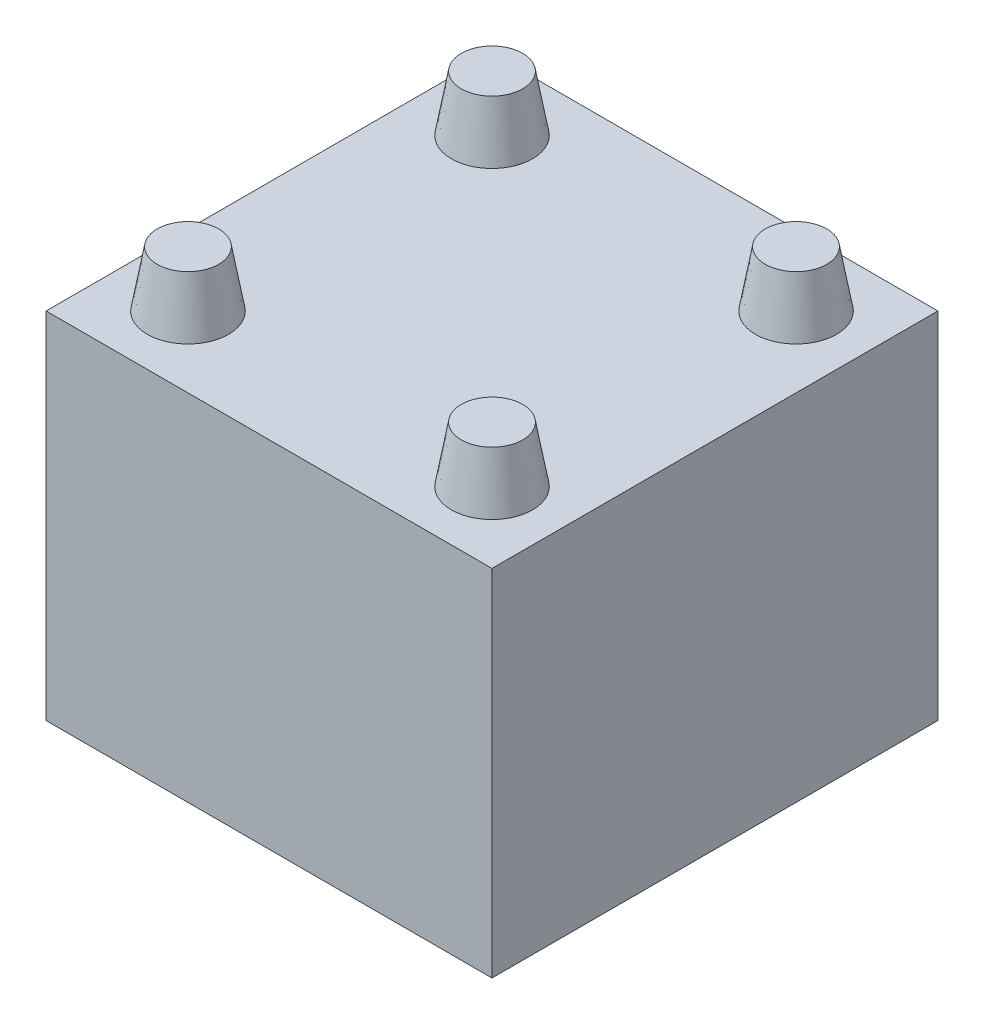
ISO-10303-21;
HEADER;
FILE_DESCRIPTION(('STEP AP214'),'2;1');
FILE_NAME('part.step','',(''),(''),'','','');
FILE_SCHEMA(('AUTOMOTIVE_DESIGN { 1 0 10303 214 1 1 1 1 }'));
ENDSEC;
DATA;
#1=APPLICATION_CONTEXT('core data for automotive mechanical design processes');
#2=APPLICATION_PROTOCOL_DEFINITION('international standard','automotive_design',2000,#1);
#3=PRODUCT_CONTEXT('',#1,'mechanical');
#4=PRODUCT('Part','Part','',(#3));
#5=PRODUCT_RELATED_PRODUCT_CATEGORY('part','',(#4));
#6=PRODUCT_DEFINITION_FORMATION('','',#4);
#7=PRODUCT_DEFINITION_CONTEXT('part definition',#1,'design');
#8=PRODUCT_DEFINITION('design','',#6,#7);
#9=PRODUCT_DEFINITION_SHAPE('','',#8);
#10=(LENGTH_UNIT() NAMED_UNIT(*) SI_UNIT(.MILLI.,.METRE.));
#11=(NAMED_UNIT(*) PLANE_ANGLE_UNIT() SI_UNIT($,.RADIAN.));
#12=(NAMED_UNIT(*) SI_UNIT($,.STERADIAN.) SOLID_ANGLE_UNIT());
#13=UNCERTAINTY_MEASURE_WITH_UNIT(LENGTH_MEASURE(1.E-05),#10,'distance_accuracy_value','');
#14=(GEOMETRIC_REPRESENTATION_CONTEXT(3) GLOBAL_UNCERTAINTY_ASSIGNED_CONTEXT((#13)) GLOBAL_UNIT_ASSIGNED_CONTEXT((#10,
#11,#12)) REPRESENTATION_CONTEXT('',''));
#15=CARTESIAN_POINT('',(0.,0.,0.));
#16=DIRECTION('',(0.,0.,1.));
#17=DIRECTION('',(1.,0.,0.));
#18=AXIS2_PLACEMENT_3D('',#15,#16,#17);
#19=CARTESIAN_POINT('',(-11.,3.,11.));
#20=DIRECTION('',(1.,0.,0.));
#21=DIRECTION('',(0.,0.,-1.));
#22=AXIS2_PLACEMENT_3D('',#19,#20,#21);
#23=PLANE('',#22);
#24=DIRECTION('',(0.,0.,1.));
#25=VECTOR('',#24,1.);
#26=CARTESIAN_POINT('',(-11.,0.,11.));
#27=LINE('',#26,#25);
#28=CARTESIAN_POINT('',(-11.,0.,-11.));
#29=VERTEX_POINT('',#28);
#30=CARTESIAN_POINT('',(-11.,0.,11.));
#31=VERTEX_POINT('',#30);
#32=EDGE_CURVE('E147',#29,#31,#27,.T.);
#33=ORIENTED_EDGE('',*,*,#32,.T.);
#34=DIRECTION('',(0.,-1.,0.));
#35=VECTOR('',#34,1.);
#36=CARTESIAN_POINT('',(-11.,3.,11.));
#37=LINE('',#36,#35);
#38=CARTESIAN_POINT('',(-11.,17.5,11.));
#39=VERTEX_POINT('',#38);
#40=EDGE_CURVE('E12',#39,#31,#37,.T.);
#41=ORIENTED_EDGE('',*,*,#40,.F.);
#42=DIRECTION('',(0.,0.,1.));
#43=VECTOR('',#42,1.);
#44=CARTESIAN_POINT('',(-11.,17.5,-11.));
#45=LINE('',#44,#43);
#46=CARTESIAN_POINT('',(-11.,17.5,-11.));
#47=VERTEX_POINT('',#46);
#48=EDGE_CURVE('E107',#47,#39,#45,.T.);
#49=ORIENTED_EDGE('',*,*,#48,.F.);
#50=DIRECTION('',(0.,-1.,0.));
#51=VECTOR('',#50,1.);
#52=CARTESIAN_POINT('',(-11.,3.,-11.));
#53=LINE('',#52,#51);
#54=EDGE_CURVE('E157',#47,#29,#53,.T.);
#55=ORIENTED_EDGE('',*,*,#54,.T.);
#56=EDGE_LOOP('',(#33,#41,#49,#55));
#57=FACE_BOUND('',#56,.T.);
#58=ADVANCED_FACE('F47',(#57),#23,.F.);
#59=CARTESIAN_POINT('',(-11.,3.,11.));
#60=DIRECTION('',(0.,0.,-1.));
#61=DIRECTION('',(-1.,0.,0.));
#62=AXIS2_PLACEMENT_3D('',#59,#60,#61);
#63=PLANE('',#62);
#64=DIRECTION('',(1.,0.,0.));
#65=VECTOR('',#64,1.);
#66=CARTESIAN_POINT('',(-11.,0.,11.));
#67=LINE('',#66,#65);
#68=CARTESIAN_POINT('',(11.,0.,11.));
#69=VERTEX_POINT('',#68);
#70=EDGE_CURVE('E93',#31,#69,#67,.T.);
#71=ORIENTED_EDGE('',*,*,#70,.T.);
#72=DIRECTION('',(0.,-1.,0.));
#73=VECTOR('',#72,1.);
#74=CARTESIAN_POINT('',(11.,3.,11.));
#75=LINE('',#74,#73);
#76=CARTESIAN_POINT('',(11.,17.5,11.));
#77=VERTEX_POINT('',#76);
#78=EDGE_CURVE('E55',#77,#69,#75,.T.);
#79=ORIENTED_EDGE('',*,*,#78,.F.);
#80=DIRECTION('',(1.,0.,0.));
#81=VECTOR('',#80,1.);
#82=CARTESIAN_POINT('',(-11.,17.5,11.));
#83=LINE('',#82,#81);
#84=EDGE_CURVE('E91',#39,#77,#83,.T.);
#85=ORIENTED_EDGE('',*,*,#84,.F.);
#86=ORIENTED_EDGE('',*,*,#40,.T.);
#87=EDGE_LOOP('',(#71,#79,#85,#86));
#88=FACE_BOUND('',#87,.T.);
#89=ADVANCED_FACE('F89',(#88),#63,.F.);
#90=CARTESIAN_POINT('',(11.,3.,11.));
#91=DIRECTION('',(-1.,0.,0.));
#92=DIRECTION('',(0.,0.,1.));
#93=AXIS2_PLACEMENT_3D('',#90,#91,#92);
#94=PLANE('',#93);
#95=DIRECTION('',(0.,0.,-1.));
#96=VECTOR('',#95,1.);
#97=CARTESIAN_POINT('',(11.,0.,11.));
#98=LINE('',#97,#96);
#99=CARTESIAN_POINT('',(11.,0.,-11.));
#100=VERTEX_POINT('',#99);
#101=EDGE_CURVE('E70',#69,#100,#98,.T.);
#102=ORIENTED_EDGE('',*,*,#101,.T.);
#103=DIRECTION('',(0.,-1.,0.));
#104=VECTOR('',#103,1.);
#105=CARTESIAN_POINT('',(11.,3.,-11.));
#106=LINE('',#105,#104);
#107=CARTESIAN_POINT('',(11.,17.5,-11.));
#108=VERTEX_POINT('',#107);
#109=EDGE_CURVE('E95',#108,#100,#106,.T.);
#110=ORIENTED_EDGE('',*,*,#109,.F.);
#111=DIRECTION('',(0.,0.,-1.));
#112=VECTOR('',#111,1.);
#113=CARTESIAN_POINT('',(11.,17.5,11.));
#114=LINE('',#113,#112);
#115=EDGE_CURVE('E97',#77,#108,#114,.T.);
#116=ORIENTED_EDGE('',*,*,#115,.F.);
#117=ORIENTED_EDGE('',*,*,#78,.T.);
#118=EDGE_LOOP('',(#102,#110,#116,#117));
#119=FACE_BOUND('',#118,.T.);
#120=ADVANCED_FACE('F98',(#119),#94,.F.);
#121=CARTESIAN_POINT('',(-11.,3.,-11.));
#122=DIRECTION('',(0.,0.,1.));
#123=DIRECTION('',(1.,0.,0.));
#124=AXIS2_PLACEMENT_3D('',#121,#122,#123);
#125=PLANE('',#124);
#126=DIRECTION('',(-1.,0.,0.));
#127=VECTOR('',#126,1.);
#128=CARTESIAN_POINT('',(-11.,0.,-11.));
#129=LINE('',#128,#127);
#130=EDGE_CURVE('E62',#100,#29,#129,.T.);
#131=ORIENTED_EDGE('',*,*,#130,.T.);
#132=ORIENTED_EDGE('',*,*,#54,.F.);
#133=DIRECTION('',(-1.,0.,0.));
#134=VECTOR('',#133,1.);
#135=CARTESIAN_POINT('',(11.,17.5,-11.));
#136=LINE('',#135,#134);
#137=EDGE_CURVE('E103',#108,#47,#136,.T.);
#138=ORIENTED_EDGE('',*,*,#137,.F.);
#139=ORIENTED_EDGE('',*,*,#109,.T.);
#140=EDGE_LOOP('',(#131,#132,#138,#139));
#141=FACE_BOUND('',#140,.T.);
#142=ADVANCED_FACE('F161',(#141),#125,.F.);
#143=CARTESIAN_POINT('',(0.,0.,0.));
#144=DIRECTION('',(0.,-1.,0.));
#145=DIRECTION('',(0.,0.,-1.));
#146=AXIS2_PLACEMENT_3D('',#143,#144,#145);
#147=PLANE('',#146);
#148=ORIENTED_EDGE('',*,*,#32,.F.);
#149=ORIENTED_EDGE('',*,*,#130,.F.);
#150=ORIENTED_EDGE('',*,*,#101,.F.);
#151=ORIENTED_EDGE('',*,*,#70,.F.);
#152=EDGE_LOOP('',(#148,#149,#150,#151));
#153=FACE_BOUND('',#152,.T.);
#154=ADVANCED_FACE('F164',(#153),#147,.T.);
#155=CARTESIAN_POINT('',(7.5,20.25,7.5));
#156=DIRECTION('',(0.,1.,0.));
#157=DIRECTION('',(0.,0.,1.));
#158=AXIS2_PLACEMENT_3D('',#155,#156,#157);
#159=PLANE('',#158);
#160=CARTESIAN_POINT('',(7.5,20.25,7.5));
#161=DIRECTION('',(0.,1.,0.));
#162=DIRECTION('',(0.,0.,1.));
#163=AXIS2_PLACEMENT_3D('',#160,#161,#162);
#164=CIRCLE('',#163,1.51510080305172);
#165=CARTESIAN_POINT('',(7.5,20.25,9.01510080305172));
#166=VERTEX_POINT('',#165);
#167=EDGE_CURVE('E127',#166,#166,#164,.T.);
#168=ORIENTED_EDGE('',*,*,#167,.T.);
#169=EDGE_LOOP('',(#168));
#170=FACE_BOUND('',#169,.T.);
#171=ADVANCED_FACE('F180',(#170),#159,.T.);
#172=CARTESIAN_POINT('',(7.5,20.25,-7.5));
#173=DIRECTION('',(0.,1.,0.));
#174=DIRECTION('',(0.,0.,1.));
#175=AXIS2_PLACEMENT_3D('',#172,#173,#174);
#176=PLANE('',#175);
#177=CARTESIAN_POINT('',(7.5,20.25,-7.5));
#178=DIRECTION('',(0.,1.,0.));
#179=DIRECTION('',(0.,0.,1.));
#180=AXIS2_PLACEMENT_3D('',#177,#178,#179);
#181=CIRCLE('',#180,1.51510080305172);
#182=CARTESIAN_POINT('',(7.5,20.25,-5.98489919694828));
#183=VERTEX_POINT('',#182);
#184=EDGE_CURVE('E123',#183,#183,#181,.T.);
#185=ORIENTED_EDGE('',*,*,#184,.T.);
#186=EDGE_LOOP('',(#185));
#187=FACE_BOUND('',#186,.T.);
#188=ADVANCED_FACE('F188',(#187),#176,.T.);
#189=CARTESIAN_POINT('',(-7.5,20.25,-7.5));
#190=DIRECTION('',(0.,1.,0.));
#191=DIRECTION('',(0.,0.,1.));
#192=AXIS2_PLACEMENT_3D('',#189,#190,#191);
#193=PLANE('',#192);
#194=CARTESIAN_POINT('',(-7.5,20.25,-7.5));
#195=DIRECTION('',(0.,1.,0.));
#196=DIRECTION('',(0.,0.,1.));
#197=AXIS2_PLACEMENT_3D('',#194,#195,#196);
#198=CIRCLE('',#197,1.51510080305172);
#199=CARTESIAN_POINT('',(-7.5,20.25,-5.98489919694828));
#200=VERTEX_POINT('',#199);
#201=EDGE_CURVE('E114',#200,#200,#198,.T.);
#202=ORIENTED_EDGE('',*,*,#201,.T.);
#203=EDGE_LOOP('',(#202));
#204=FACE_BOUND('',#203,.T.);
#205=ADVANCED_FACE('F192',(#204),#193,.T.);
#206=CARTESIAN_POINT('',(-7.5,20.25,7.5));
#207=DIRECTION('',(0.,1.,0.));
#208=DIRECTION('',(0.,0.,1.));
#209=AXIS2_PLACEMENT_3D('',#206,#207,#208);
#210=PLANE('',#209);
#211=CARTESIAN_POINT('',(-7.5,20.25,7.5));
#212=DIRECTION('',(0.,1.,0.));
#213=DIRECTION('',(0.,0.,1.));
#214=AXIS2_PLACEMENT_3D('',#211,#212,#213);
#215=CIRCLE('',#214,1.51510080305172);
#216=CARTESIAN_POINT('',(-7.5,20.25,9.01510080305172));
#217=VERTEX_POINT('',#216);
#218=EDGE_CURVE('E109',#217,#217,#215,.T.);
#219=ORIENTED_EDGE('',*,*,#218,.T.);
#220=EDGE_LOOP('',(#219));
#221=FACE_BOUND('',#220,.T.);
#222=ADVANCED_FACE('F200',(#221),#210,.T.);
#223=CARTESIAN_POINT('',(-7.5,17.5,7.5));
#224=DIRECTION('',(0.,1.,0.));
#225=DIRECTION('',(0.,0.,1.));
#226=AXIS2_PLACEMENT_3D('',#223,#224,#225);
#227=PLANE('',#226);
#228=CARTESIAN_POINT('',(7.5,17.5,-7.5));
#229=DIRECTION('',(0.,1.,0.));
#230=DIRECTION('',(0.,0.,1.));
#231=AXIS2_PLACEMENT_3D('',#228,#229,#230);
#232=CIRCLE('',#231,2.);
#233=CARTESIAN_POINT('',(7.5,17.5,-5.5));
#234=VERTEX_POINT('',#233);
#235=EDGE_CURVE('E139',#234,#234,#232,.T.);
#236=ORIENTED_EDGE('',*,*,#235,.F.);
#237=EDGE_LOOP('',(#236));
#238=FACE_BOUND('',#237,.T.);
#239=CARTESIAN_POINT('',(-7.5,17.5,7.5));
#240=DIRECTION('',(0.,1.,0.));
#241=DIRECTION('',(0.,0.,1.));
#242=AXIS2_PLACEMENT_3D('',#239,#240,#241);
#243=CIRCLE('',#242,2.);
#244=CARTESIAN_POINT('',(-7.5,17.5,9.5));
#245=VERTEX_POINT('',#244);
#246=EDGE_CURVE('E131',#245,#245,#243,.T.);
#247=ORIENTED_EDGE('',*,*,#246,.F.);
#248=EDGE_LOOP('',(#247));
#249=FACE_BOUND('',#248,.T.);
#250=CARTESIAN_POINT('',(-7.5,17.5,-7.5));
#251=DIRECTION('',(0.,1.,0.));
#252=DIRECTION('',(0.,0.,1.));
#253=AXIS2_PLACEMENT_3D('',#250,#251,#252);
#254=CIRCLE('',#253,2.);
#255=CARTESIAN_POINT('',(-7.5,17.5,-5.5));
#256=VERTEX_POINT('',#255);
#257=EDGE_CURVE('E143',#256,#256,#254,.T.);
#258=ORIENTED_EDGE('',*,*,#257,.F.);
#259=EDGE_LOOP('',(#258));
#260=FACE_BOUND('',#259,.T.);
#261=CARTESIAN_POINT('',(7.5,17.5,7.5));
#262=DIRECTION('',(0.,1.,0.));
#263=DIRECTION('',(0.,0.,1.));
#264=AXIS2_PLACEMENT_3D('',#261,#262,#263);
#265=CIRCLE('',#264,2.);
#266=CARTESIAN_POINT('',(7.5,17.5,9.5));
#267=VERTEX_POINT('',#266);
#268=EDGE_CURVE('E135',#267,#267,#265,.T.);
#269=ORIENTED_EDGE('',*,*,#268,.F.);
#270=EDGE_LOOP('',(#269));
#271=FACE_BOUND('',#270,.T.);
#272=ORIENTED_EDGE('',*,*,#115,.T.);
#273=ORIENTED_EDGE('',*,*,#137,.T.);
#274=ORIENTED_EDGE('',*,*,#48,.T.);
#275=ORIENTED_EDGE('',*,*,#84,.T.);
#276=EDGE_LOOP('',(#272,#273,#274,#275));
#277=FACE_BOUND('',#276,.T.);
#278=ADVANCED_FACE('F105',(#238,#249,#260,#271,#277),#227,.T.);
#279=CARTESIAN_POINT('',(-7.5,17.5,7.5));
#280=DIRECTION('',(0.,-1.,0.));
#281=DIRECTION('',(0.,0.,1.));
#282=AXIS2_PLACEMENT_3D('',#279,#280,#281);
#283=CONICAL_SURFACE('',#282,2.,0.174532925199433);
#284=ORIENTED_EDGE('',*,*,#218,.F.);
#285=EDGE_LOOP('',(#284));
#286=FACE_BOUND('',#285,.T.);
#287=ORIENTED_EDGE('',*,*,#246,.T.);
#288=EDGE_LOOP('',(#287));
#289=FACE_BOUND('',#288,.T.);
#290=ADVANCED_FACE('F204',(#286,#289),#283,.T.);
#291=CARTESIAN_POINT('',(-7.5,17.5,-7.5));
#292=DIRECTION('',(0.,-1.,0.));
#293=DIRECTION('',(0.,0.,1.));
#294=AXIS2_PLACEMENT_3D('',#291,#292,#293);
#295=CONICAL_SURFACE('',#294,2.,0.174532925199433);
#296=ORIENTED_EDGE('',*,*,#201,.F.);
#297=EDGE_LOOP('',(#296));
#298=FACE_BOUND('',#297,.T.);
#299=ORIENTED_EDGE('',*,*,#257,.T.);
#300=EDGE_LOOP('',(#299));
#301=FACE_BOUND('',#300,.T.);
#302=ADVANCED_FACE('F196',(#298,#301),#295,.T.);
#303=CARTESIAN_POINT('',(7.5,17.5,-7.5));
#304=DIRECTION('',(0.,-1.,0.));
#305=DIRECTION('',(0.,0.,1.));
#306=AXIS2_PLACEMENT_3D('',#303,#304,#305);
#307=CONICAL_SURFACE('',#306,2.,0.174532925199433);
#308=ORIENTED_EDGE('',*,*,#184,.F.);
#309=EDGE_LOOP('',(#308));
#310=FACE_BOUND('',#309,.T.);
#311=ORIENTED_EDGE('',*,*,#235,.T.);
#312=EDGE_LOOP('',(#311));
#313=FACE_BOUND('',#312,.T.);
#314=ADVANCED_FACE('F184',(#310,#313),#307,.T.);
#315=CARTESIAN_POINT('',(7.5,17.5,7.5));
#316=DIRECTION('',(0.,-1.,0.));
#317=DIRECTION('',(0.,0.,1.));
#318=AXIS2_PLACEMENT_3D('',#315,#316,#317);
#319=CONICAL_SURFACE('',#318,2.,0.174532925199433);
#320=ORIENTED_EDGE('',*,*,#167,.F.);
#321=EDGE_LOOP('',(#320));
#322=FACE_BOUND('',#321,.T.);
#323=ORIENTED_EDGE('',*,*,#268,.T.);
#324=EDGE_LOOP('',(#323));
#325=FACE_BOUND('',#324,.T.);
#326=ADVANCED_FACE('F181',(#322,#325),#319,.T.);
#327=CLOSED_SHELL('',(#58,#89,#120,#142,#154,#171,#188,#205,#222,#278,#290,#302,#314,#326));
#328=MANIFOLD_SOLID_BREP('B2',#327);
#329=ADVANCED_BREP_SHAPE_REPRESENTATION('',(#18,#328),#14);
#330=SHAPE_DEFINITION_REPRESENTATION(#9,#329);
ENDSEC;
END-ISO-10303-21;
